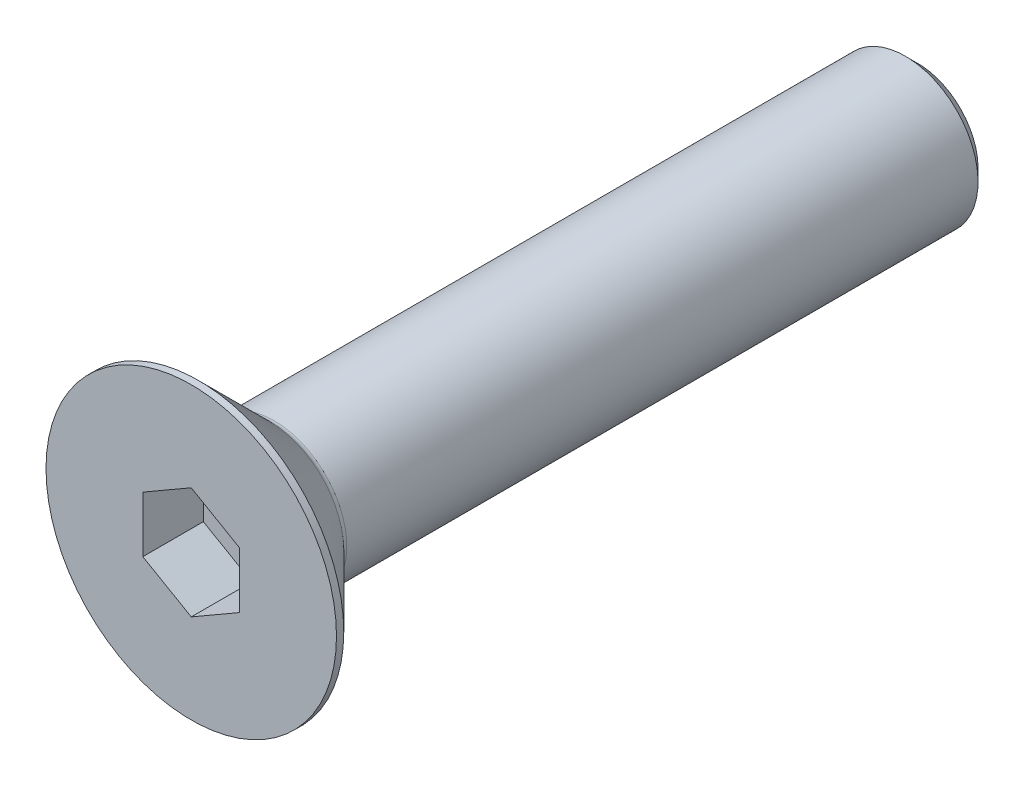
ISO-10303-21;
HEADER;
FILE_DESCRIPTION(('STEP AP214'),'2;1');
FILE_NAME('part.step','',(''),(''),'','','');
FILE_SCHEMA(('AUTOMOTIVE_DESIGN { 1 0 10303 214 1 1 1 1 }'));
ENDSEC;
DATA;
#1=APPLICATION_CONTEXT('core data for automotive mechanical design processes');
#2=APPLICATION_PROTOCOL_DEFINITION('international standard','automotive_design',2000,#1);
#3=PRODUCT_CONTEXT('',#1,'mechanical');
#4=PRODUCT('Part','Part','',(#3));
#5=PRODUCT_RELATED_PRODUCT_CATEGORY('part','',(#4));
#6=PRODUCT_DEFINITION_FORMATION('','',#4);
#7=PRODUCT_DEFINITION_CONTEXT('part definition',#1,'design');
#8=PRODUCT_DEFINITION('design','',#6,#7);
#9=PRODUCT_DEFINITION_SHAPE('','',#8);
#10=(LENGTH_UNIT() NAMED_UNIT(*) SI_UNIT(.MILLI.,.METRE.));
#11=(NAMED_UNIT(*) PLANE_ANGLE_UNIT() SI_UNIT($,.RADIAN.));
#12=(NAMED_UNIT(*) SI_UNIT($,.STERADIAN.) SOLID_ANGLE_UNIT());
#13=UNCERTAINTY_MEASURE_WITH_UNIT(LENGTH_MEASURE(1.E-05),#10,'distance_accuracy_value','');
#14=(GEOMETRIC_REPRESENTATION_CONTEXT(3) GLOBAL_UNCERTAINTY_ASSIGNED_CONTEXT((#13)) GLOBAL_UNIT_ASSIGNED_CONTEXT((#10,
#11,#12)) REPRESENTATION_CONTEXT('',''));
#15=CARTESIAN_POINT('',(0.,0.,0.));
#16=DIRECTION('',(0.,0.,1.));
#17=DIRECTION('',(1.,0.,0.));
#18=AXIS2_PLACEMENT_3D('',#15,#16,#17);
#19=CARTESIAN_POINT('',(0.,0.,-2.5));
#20=DIRECTION('',(0.,0.,1.));
#21=DIRECTION('',(1.,0.,0.));
#22=AXIS2_PLACEMENT_3D('',#19,#20,#21);
#23=PLANE('',#22);
#24=DIRECTION('',(-0.866025403784439,-0.5,0.));
#25=VECTOR('',#24,1.);
#26=CARTESIAN_POINT('',(0.,2.3094010767585,-2.5));
#27=LINE('',#26,#25);
#28=CARTESIAN_POINT('',(0.,2.3094010767585,-2.5));
#29=VERTEX_POINT('',#28);
#30=CARTESIAN_POINT('',(-2.,1.15470053837925,-2.5));
#31=VERTEX_POINT('',#30);
#32=EDGE_CURVE('E82',#29,#31,#27,.T.);
#33=ORIENTED_EDGE('',*,*,#32,.T.);
#34=DIRECTION('',(0.,1.,0.));
#35=VECTOR('',#34,1.);
#36=CARTESIAN_POINT('',(-2.,1.15470053837925,-2.5));
#37=LINE('',#36,#35);
#38=CARTESIAN_POINT('',(-2.,-1.15470053837925,-2.5));
#39=VERTEX_POINT('',#38);
#40=EDGE_CURVE('E66',#31,#39,#37,.F.);
#41=ORIENTED_EDGE('',*,*,#40,.T.);
#42=DIRECTION('',(0.866025403784439,-0.499999999999999,0.));
#43=VECTOR('',#42,1.);
#44=CARTESIAN_POINT('',(-2.,-1.15470053837925,-2.5));
#45=LINE('',#44,#43);
#46=CARTESIAN_POINT('',(0.,-2.3094010767585,-2.5));
#47=VERTEX_POINT('',#46);
#48=EDGE_CURVE('E71',#39,#47,#45,.T.);
#49=ORIENTED_EDGE('',*,*,#48,.T.);
#50=DIRECTION('',(0.866025403784439,0.5,0.));
#51=VECTOR('',#50,1.);
#52=CARTESIAN_POINT('',(0.,-2.3094010767585,-2.5));
#53=LINE('',#52,#51);
#54=CARTESIAN_POINT('',(2.,-1.15470053837925,-2.5));
#55=VERTEX_POINT('',#54);
#56=EDGE_CURVE('E128',#47,#55,#53,.T.);
#57=ORIENTED_EDGE('',*,*,#56,.T.);
#58=DIRECTION('',(0.,1.,0.));
#59=VECTOR('',#58,1.);
#60=CARTESIAN_POINT('',(2.,-1.15470053837925,-2.5));
#61=LINE('',#60,#59);
#62=CARTESIAN_POINT('',(2.,1.15470053837925,-2.5));
#63=VERTEX_POINT('',#62);
#64=EDGE_CURVE('E132',#55,#63,#61,.T.);
#65=ORIENTED_EDGE('',*,*,#64,.T.);
#66=DIRECTION('',(-0.866025403784439,0.499999999999999,0.));
#67=VECTOR('',#66,1.);
#68=CARTESIAN_POINT('',(2.,1.15470053837925,-2.5));
#69=LINE('',#68,#67);
#70=EDGE_CURVE('E137',#63,#29,#69,.T.);
#71=ORIENTED_EDGE('',*,*,#70,.T.);
#72=EDGE_LOOP('',(#33,#41,#49,#57,#65,#71));
#73=FACE_BOUND('',#72,.T.);
#74=ADVANCED_FACE('F15',(#73),#23,.T.);
#75=CARTESIAN_POINT('',(-2.,-1.15470053837925,0.));
#76=DIRECTION('',(-0.499999999999999,-0.866025403784439,0.));
#77=DIRECTION('',(0.866025403784439,-0.499999999999999,0.));
#78=AXIS2_PLACEMENT_3D('',#75,#76,#77);
#79=PLANE('',#78);
#80=DIRECTION('',(0.,0.,1.));
#81=VECTOR('',#80,1.);
#82=CARTESIAN_POINT('',(-2.,-1.15470053837925,0.));
#83=LINE('',#82,#81);
#84=CARTESIAN_POINT('',(-2.,-1.15470053837925,0.));
#85=VERTEX_POINT('',#84);
#86=EDGE_CURVE('E73',#39,#85,#83,.T.);
#87=ORIENTED_EDGE('',*,*,#86,.T.);
#88=DIRECTION('',(-0.866025403784439,0.499999999999999,0.));
#89=VECTOR('',#88,1.);
#90=CARTESIAN_POINT('',(0.,-2.3094010767585,0.));
#91=LINE('',#90,#89);
#92=CARTESIAN_POINT('',(0.,-2.3094010767585,0.));
#93=VERTEX_POINT('',#92);
#94=EDGE_CURVE('E126',#93,#85,#91,.T.);
#95=ORIENTED_EDGE('',*,*,#94,.F.);
#96=DIRECTION('',(0.,0.,1.));
#97=VECTOR('',#96,1.);
#98=CARTESIAN_POINT('',(0.,-2.3094010767585,0.));
#99=LINE('',#98,#97);
#100=EDGE_CURVE('E76',#93,#47,#99,.F.);
#101=ORIENTED_EDGE('',*,*,#100,.T.);
#102=ORIENTED_EDGE('',*,*,#48,.F.);
#103=EDGE_LOOP('',(#87,#95,#101,#102));
#104=FACE_BOUND('',#103,.T.);
#105=ADVANCED_FACE('F72',(#104),#79,.F.);
#106=CARTESIAN_POINT('',(-2.,1.15470053837925,0.));
#107=DIRECTION('',(-1.,0.,0.));
#108=DIRECTION('',(0.,0.,1.));
#109=AXIS2_PLACEMENT_3D('',#106,#107,#108);
#110=PLANE('',#109);
#111=DIRECTION('',(0.,0.,1.));
#112=VECTOR('',#111,1.);
#113=CARTESIAN_POINT('',(-2.,1.15470053837925,0.));
#114=LINE('',#113,#112);
#115=CARTESIAN_POINT('',(-2.,1.15470053837925,0.));
#116=VERTEX_POINT('',#115);
#117=EDGE_CURVE('E84',#31,#116,#114,.T.);
#118=ORIENTED_EDGE('',*,*,#117,.T.);
#119=DIRECTION('',(0.,1.,0.));
#120=VECTOR('',#119,1.);
#121=CARTESIAN_POINT('',(-2.,0.,0.));
#122=LINE('',#121,#120);
#123=EDGE_CURVE('E88',#85,#116,#122,.T.);
#124=ORIENTED_EDGE('',*,*,#123,.F.);
#125=ORIENTED_EDGE('',*,*,#86,.F.);
#126=ORIENTED_EDGE('',*,*,#40,.F.);
#127=EDGE_LOOP('',(#118,#124,#125,#126));
#128=FACE_BOUND('',#127,.T.);
#129=ADVANCED_FACE('F86',(#128),#110,.F.);
#130=CARTESIAN_POINT('',(0.,2.3094010767585,0.));
#131=DIRECTION('',(-0.5,0.866025403784439,0.));
#132=DIRECTION('',(-0.866025403784439,-0.5,0.));
#133=AXIS2_PLACEMENT_3D('',#130,#131,#132);
#134=PLANE('',#133);
#135=DIRECTION('',(0.,0.,1.));
#136=VECTOR('',#135,1.);
#137=CARTESIAN_POINT('',(0.,2.3094010767585,0.));
#138=LINE('',#137,#136);
#139=CARTESIAN_POINT('',(0.,2.3094010767585,0.));
#140=VERTEX_POINT('',#139);
#141=EDGE_CURVE('E139',#29,#140,#138,.T.);
#142=ORIENTED_EDGE('',*,*,#141,.T.);
#143=DIRECTION('',(0.866025403784439,0.5,0.));
#144=VECTOR('',#143,1.);
#145=CARTESIAN_POINT('',(-2.,1.15470053837925,0.));
#146=LINE('',#145,#144);
#147=EDGE_CURVE('E122',#116,#140,#146,.T.);
#148=ORIENTED_EDGE('',*,*,#147,.F.);
#149=ORIENTED_EDGE('',*,*,#117,.F.);
#150=ORIENTED_EDGE('',*,*,#32,.F.);
#151=EDGE_LOOP('',(#142,#148,#149,#150));
#152=FACE_BOUND('',#151,.T.);
#153=ADVANCED_FACE('F143',(#152),#134,.F.);
#154=CARTESIAN_POINT('',(2.,1.15470053837925,0.));
#155=DIRECTION('',(0.499999999999999,0.866025403784439,0.));
#156=DIRECTION('',(-0.866025403784439,0.499999999999999,0.));
#157=AXIS2_PLACEMENT_3D('',#154,#155,#156);
#158=PLANE('',#157);
#159=DIRECTION('',(0.,0.,-1.));
#160=VECTOR('',#159,1.);
#161=CARTESIAN_POINT('',(2.,1.15470053837925,0.));
#162=LINE('',#161,#160);
#163=CARTESIAN_POINT('',(2.,1.15470053837925,0.));
#164=VERTEX_POINT('',#163);
#165=EDGE_CURVE('E135',#63,#164,#162,.F.);
#166=ORIENTED_EDGE('',*,*,#165,.T.);
#167=DIRECTION('',(0.866025403784439,-0.499999999999999,0.));
#168=VECTOR('',#167,1.);
#169=CARTESIAN_POINT('',(0.,2.3094010767585,0.));
#170=LINE('',#169,#168);
#171=EDGE_CURVE('E119',#140,#164,#170,.T.);
#172=ORIENTED_EDGE('',*,*,#171,.F.);
#173=ORIENTED_EDGE('',*,*,#141,.F.);
#174=ORIENTED_EDGE('',*,*,#70,.F.);
#175=EDGE_LOOP('',(#166,#172,#173,#174));
#176=FACE_BOUND('',#175,.T.);
#177=ADVANCED_FACE('F154',(#176),#158,.F.);
#178=CARTESIAN_POINT('',(2.,-1.15470053837925,0.));
#179=DIRECTION('',(1.,0.,0.));
#180=DIRECTION('',(0.,0.,-1.));
#181=AXIS2_PLACEMENT_3D('',#178,#179,#180);
#182=PLANE('',#181);
#183=DIRECTION('',(0.,0.,1.));
#184=VECTOR('',#183,1.);
#185=CARTESIAN_POINT('',(2.,-1.15470053837925,0.));
#186=LINE('',#185,#184);
#187=CARTESIAN_POINT('',(2.,-1.15470053837925,0.));
#188=VERTEX_POINT('',#187);
#189=EDGE_CURVE('E34',#55,#188,#186,.T.);
#190=ORIENTED_EDGE('',*,*,#189,.T.);
#191=DIRECTION('',(0.,1.,0.));
#192=VECTOR('',#191,1.);
#193=CARTESIAN_POINT('',(2.,0.,0.));
#194=LINE('',#193,#192);
#195=EDGE_CURVE('E116',#164,#188,#194,.F.);
#196=ORIENTED_EDGE('',*,*,#195,.F.);
#197=ORIENTED_EDGE('',*,*,#165,.F.);
#198=ORIENTED_EDGE('',*,*,#64,.F.);
#199=EDGE_LOOP('',(#190,#196,#197,#198));
#200=FACE_BOUND('',#199,.T.);
#201=ADVANCED_FACE('F152',(#200),#182,.F.);
#202=CARTESIAN_POINT('',(0.,-2.3094010767585,0.));
#203=DIRECTION('',(0.5,-0.866025403784439,0.));
#204=DIRECTION('',(0.866025403784439,0.5,0.));
#205=AXIS2_PLACEMENT_3D('',#202,#203,#204);
#206=PLANE('',#205);
#207=ORIENTED_EDGE('',*,*,#100,.F.);
#208=DIRECTION('',(-0.866025403784439,-0.5,0.));
#209=VECTOR('',#208,1.);
#210=CARTESIAN_POINT('',(2.,-1.15470053837925,0.));
#211=LINE('',#210,#209);
#212=EDGE_CURVE('E113',#188,#93,#211,.T.);
#213=ORIENTED_EDGE('',*,*,#212,.F.);
#214=ORIENTED_EDGE('',*,*,#189,.F.);
#215=ORIENTED_EDGE('',*,*,#56,.F.);
#216=EDGE_LOOP('',(#207,#213,#214,#215));
#217=FACE_BOUND('',#216,.T.);
#218=ADVANCED_FACE('F150',(#217),#206,.F.);
#219=CARTESIAN_POINT('',(3.,0.,0.));
#220=DIRECTION('',(0.,0.,1.));
#221=DIRECTION('',(1.,0.,0.));
#222=AXIS2_PLACEMENT_3D('',#219,#220,#221);
#223=PLANE('',#222);
#224=ORIENTED_EDGE('',*,*,#195,.T.);
#225=ORIENTED_EDGE('',*,*,#212,.T.);
#226=ORIENTED_EDGE('',*,*,#94,.T.);
#227=ORIENTED_EDGE('',*,*,#123,.T.);
#228=ORIENTED_EDGE('',*,*,#147,.T.);
#229=ORIENTED_EDGE('',*,*,#171,.T.);
#230=EDGE_LOOP('',(#224,#225,#226,#227,#228,#229));
#231=FACE_BOUND('',#230,.T.);
#232=CARTESIAN_POINT('',(0.,0.,0.));
#233=DIRECTION('',(0.,0.,-1.));
#234=DIRECTION('',(-1.,0.,0.));
#235=AXIS2_PLACEMENT_3D('',#232,#233,#234);
#236=CIRCLE('',#235,6.);
#237=CARTESIAN_POINT('',(-6.,0.,0.));
#238=VERTEX_POINT('',#237);
#239=EDGE_CURVE('E19',#238,#238,#236,.T.);
#240=ORIENTED_EDGE('',*,*,#239,.F.);
#241=EDGE_LOOP('',(#240));
#242=FACE_BOUND('',#241,.T.);
#243=ADVANCED_FACE('F147',(#231,#242),#223,.T.);
#244=CARTESIAN_POINT('',(0.,0.,-0.150000000000001));
#245=DIRECTION('',(0.,0.,-1.));
#246=DIRECTION('',(-1.,0.,0.));
#247=AXIS2_PLACEMENT_3D('',#244,#245,#246);
#248=CYLINDRICAL_SURFACE('',#247,6.);
#249=ORIENTED_EDGE('',*,*,#239,.T.);
#250=EDGE_LOOP('',(#249));
#251=FACE_BOUND('',#250,.T.);
#252=CARTESIAN_POINT('',(0.,0.,-0.299999998617295));
#253=DIRECTION('',(0.,0.,1.));
#254=DIRECTION('',(1.,0.,0.));
#255=AXIS2_PLACEMENT_3D('',#252,#253,#254);
#256=CIRCLE('',#255,5.99999999872125);
#257=CARTESIAN_POINT('',(5.99999999872125,0.,-0.299999998617295));
#258=VERTEX_POINT('',#257);
#259=EDGE_CURVE('E100',#258,#258,#256,.F.);
#260=ORIENTED_EDGE('',*,*,#259,.F.);
#261=EDGE_LOOP('',(#260));
#262=FACE_BOUND('',#261,.T.);
#263=ADVANCED_FACE('F183',(#251,#262),#248,.T.);
#264=CARTESIAN_POINT('',(0.,0.,-0.299999998617295));
#265=DIRECTION('',(0.,0.,1.));
#266=DIRECTION('',(1.,0.,0.));
#267=AXIS2_PLACEMENT_3D('',#264,#265,#266);
#268=CONICAL_SURFACE('',#267,5.99999999872125,0.78539816249955);
#269=CARTESIAN_POINT('',(0.,0.,-3.21213203435597));
#270=DIRECTION('',(0.,0.,-1.));
#271=DIRECTION('',(0.,1.,0.));
#272=AXIS2_PLACEMENT_3D('',#269,#270,#271);
#273=CIRCLE('',#272,3.08786796564404);
#274=CARTESIAN_POINT('',(0.,3.08786796564404,-3.21213203435597));
#275=VERTEX_POINT('',#274);
#276=EDGE_CURVE('E94',#275,#275,#273,.T.);
#277=ORIENTED_EDGE('',*,*,#276,.F.);
#278=EDGE_LOOP('',(#277));
#279=FACE_BOUND('',#278,.T.);
#280=ORIENTED_EDGE('',*,*,#259,.T.);
#281=EDGE_LOOP('',(#280));
#282=FACE_BOUND('',#281,.T.);
#283=ADVANCED_FACE('F179',(#279,#282),#268,.T.);
#284=CARTESIAN_POINT('',(1.5,0.,-30.));
#285=DIRECTION('',(0.,0.,-1.));
#286=DIRECTION('',(-1.,0.,0.));
#287=AXIS2_PLACEMENT_3D('',#284,#285,#286);
#288=PLANE('',#287);
#289=CARTESIAN_POINT('',(0.,0.,-30.0000000002001));
#290=DIRECTION('',(0.,0.,1.));
#291=DIRECTION('',(0.,-1.,0.));
#292=AXIS2_PLACEMENT_3D('',#289,#290,#291);
#293=CIRCLE('',#292,2.5000000002251);
#294=CARTESIAN_POINT('',(0.,-2.5000000002251,-30.0000000002001));
#295=VERTEX_POINT('',#294);
#296=EDGE_CURVE('E92',#295,#295,#293,.T.);
#297=ORIENTED_EDGE('',*,*,#296,.F.);
#298=EDGE_LOOP('',(#297));
#299=FACE_BOUND('',#298,.T.);
#300=ADVANCED_FACE('F176',(#299),#288,.T.);
#301=CARTESIAN_POINT('',(0.,0.,-3.42426406871193));
#302=DIRECTION('',(0.,0.,-1.));
#303=DIRECTION('',(0.,1.,0.));
#304=AXIS2_PLACEMENT_3D('',#301,#302,#303);
#305=TOROIDAL_SURFACE('',#304,3.3,0.3);
#306=CARTESIAN_POINT('',(0.,0.,-3.42426406871193));
#307=DIRECTION('',(0.,0.,-1.));
#308=DIRECTION('',(-1.,0.,0.));
#309=AXIS2_PLACEMENT_3D('',#306,#307,#308);
#310=CIRCLE('',#309,3.);
#311=CARTESIAN_POINT('',(-3.,0.,-3.42426406871193));
#312=VERTEX_POINT('',#311);
#313=EDGE_CURVE('E25',#312,#312,#310,.T.);
#314=ORIENTED_EDGE('',*,*,#313,.F.);
#315=EDGE_LOOP('',(#314));
#316=FACE_BOUND('',#315,.T.);
#317=ORIENTED_EDGE('',*,*,#276,.T.);
#318=EDGE_LOOP('',(#317));
#319=FACE_BOUND('',#318,.T.);
#320=ADVANCED_FACE('F17',(#316,#319),#305,.F.);
#321=CARTESIAN_POINT('',(0.,0.,-29.4999999997572));
#322=DIRECTION('',(0.,0.,1.));
#323=DIRECTION('',(0.,-1.,0.));
#324=AXIS2_PLACEMENT_3D('',#321,#322,#323);
#325=CONICAL_SURFACE('',#324,2.99999999975853,0.785398162487954);
#326=ORIENTED_EDGE('',*,*,#296,.T.);
#327=EDGE_LOOP('',(#326));
#328=FACE_BOUND('',#327,.T.);
#329=CARTESIAN_POINT('',(0.,0.,-29.5));
#330=DIRECTION('',(0.,0.,-1.));
#331=DIRECTION('',(-1.,0.,0.));
#332=AXIS2_PLACEMENT_3D('',#329,#330,#331);
#333=CIRCLE('',#332,3.);
#334=CARTESIAN_POINT('',(-3.,0.,-29.5));
#335=VERTEX_POINT('',#334);
#336=EDGE_CURVE('E10',#335,#335,#333,.F.);
#337=ORIENTED_EDGE('',*,*,#336,.F.);
#338=EDGE_LOOP('',(#337));
#339=FACE_BOUND('',#338,.T.);
#340=ADVANCED_FACE('F166',(#328,#339),#325,.T.);
#341=CARTESIAN_POINT('',(0.,0.,-16.65));
#342=DIRECTION('',(0.,0.,-1.));
#343=DIRECTION('',(-1.,0.,0.));
#344=AXIS2_PLACEMENT_3D('',#341,#342,#343);
#345=CYLINDRICAL_SURFACE('',#344,3.);
#346=ORIENTED_EDGE('',*,*,#336,.T.);
#347=EDGE_LOOP('',(#346));
#348=FACE_BOUND('',#347,.T.);
#349=ORIENTED_EDGE('',*,*,#313,.T.);
#350=EDGE_LOOP('',(#349));
#351=FACE_BOUND('',#350,.T.);
#352=ADVANCED_FACE('F164',(#348,#351),#345,.T.);
#353=CLOSED_SHELL('',(#74,#105,#129,#153,#177,#201,#218,#243,#263,#283,#300,#320,#340,#352));
#354=MANIFOLD_SOLID_BREP('B1',#353);
#355=ADVANCED_BREP_SHAPE_REPRESENTATION('',(#18,#354),#14);
#356=SHAPE_DEFINITION_REPRESENTATION(#9,#355);
ENDSEC;
END-ISO-10303-21;
